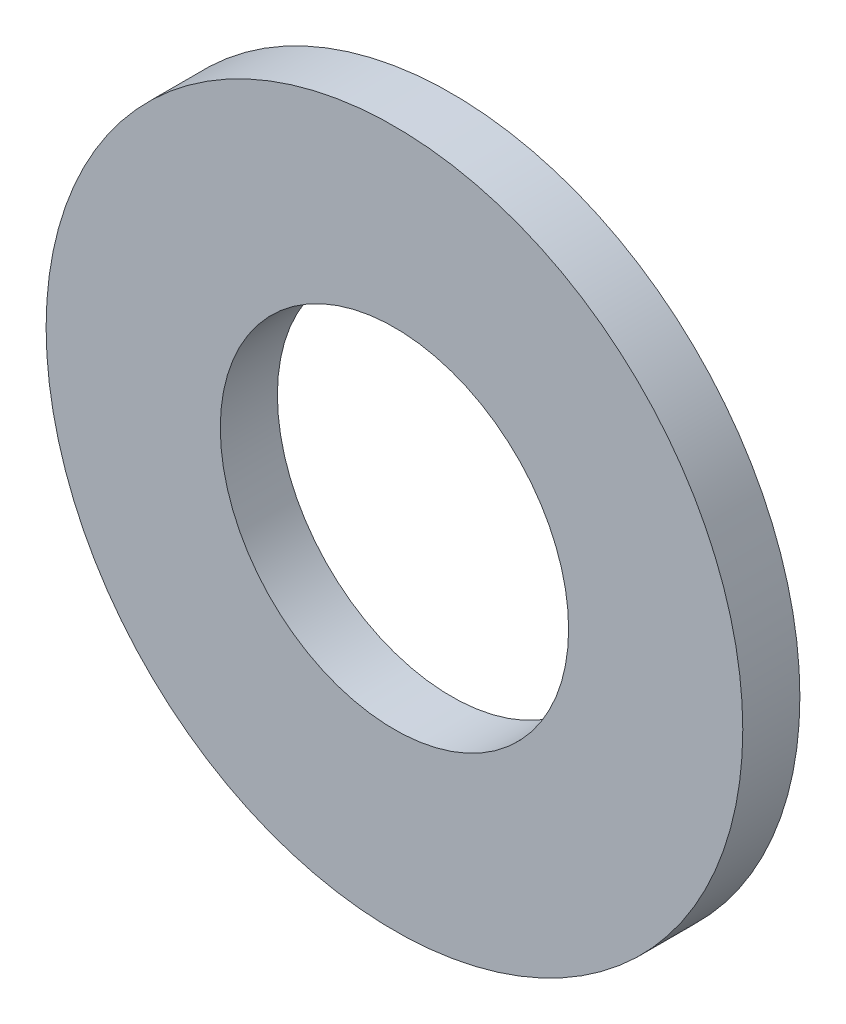
ISO-10303-21;
HEADER;
FILE_DESCRIPTION(('STEP AP214'),'2;1');
FILE_NAME('part.step','',(''),(''),'','','');
FILE_SCHEMA(('AUTOMOTIVE_DESIGN { 1 0 10303 214 1 1 1 1 }'));
ENDSEC;
DATA;
#1=APPLICATION_CONTEXT('core data for automotive mechanical design processes');
#2=APPLICATION_PROTOCOL_DEFINITION('international standard','automotive_design',2000,#1);
#3=PRODUCT_CONTEXT('',#1,'mechanical');
#4=PRODUCT('Part','Part','',(#3));
#5=PRODUCT_RELATED_PRODUCT_CATEGORY('part','',(#4));
#6=PRODUCT_DEFINITION_FORMATION('','',#4);
#7=PRODUCT_DEFINITION_CONTEXT('part definition',#1,'design');
#8=PRODUCT_DEFINITION('design','',#6,#7);
#9=PRODUCT_DEFINITION_SHAPE('','',#8);
#10=(LENGTH_UNIT() NAMED_UNIT(*) SI_UNIT(.MILLI.,.METRE.));
#11=(NAMED_UNIT(*) PLANE_ANGLE_UNIT() SI_UNIT($,.RADIAN.));
#12=(NAMED_UNIT(*) SI_UNIT($,.STERADIAN.) SOLID_ANGLE_UNIT());
#13=UNCERTAINTY_MEASURE_WITH_UNIT(LENGTH_MEASURE(1.E-05),#10,'distance_accuracy_value','');
#14=(GEOMETRIC_REPRESENTATION_CONTEXT(3) GLOBAL_UNCERTAINTY_ASSIGNED_CONTEXT((#13)) GLOBAL_UNIT_ASSIGNED_CONTEXT((#10,
#11,#12)) REPRESENTATION_CONTEXT('',''));
#15=CARTESIAN_POINT('',(0.,0.,0.));
#16=DIRECTION('',(0.,0.,1.));
#17=DIRECTION('',(1.,0.,0.));
#18=AXIS2_PLACEMENT_3D('',#15,#16,#17);
#19=CARTESIAN_POINT('',(0.,0.,1.));
#20=DIRECTION('',(0.,0.,1.));
#21=DIRECTION('',(1.,0.,0.));
#22=AXIS2_PLACEMENT_3D('',#19,#20,#21);
#23=PLANE('',#22);
#24=CARTESIAN_POINT('',(0.,0.,1.));
#25=DIRECTION('',(0.,0.,1.));
#26=DIRECTION('',(1.,0.,0.));
#27=AXIS2_PLACEMENT_3D('',#24,#25,#26);
#28=CIRCLE('',#27,6.1);
#29=CARTESIAN_POINT('',(6.1,0.,1.));
#30=VERTEX_POINT('',#29);
#31=EDGE_CURVE('E10',#30,#30,#28,.T.);
#32=ORIENTED_EDGE('',*,*,#31,.T.);
#33=EDGE_LOOP('',(#32));
#34=FACE_BOUND('',#33,.T.);
#35=CARTESIAN_POINT('',(0.,0.,1.));
#36=DIRECTION('',(0.,0.,1.));
#37=DIRECTION('',(1.,0.,0.));
#38=AXIS2_PLACEMENT_3D('',#35,#36,#37);
#39=CIRCLE('',#38,3.05);
#40=CARTESIAN_POINT('',(3.05,0.,1.));
#41=VERTEX_POINT('',#40);
#42=EDGE_CURVE('E47',#41,#41,#39,.T.);
#43=ORIENTED_EDGE('',*,*,#42,.F.);
#44=EDGE_LOOP('',(#43));
#45=FACE_BOUND('',#44,.T.);
#46=ADVANCED_FACE('F34',(#34,#45),#23,.T.);
#47=CARTESIAN_POINT('',(0.,0.,0.));
#48=DIRECTION('',(0.,0.,1.));
#49=DIRECTION('',(1.,0.,0.));
#50=AXIS2_PLACEMENT_3D('',#47,#48,#49);
#51=PLANE('',#50);
#52=CARTESIAN_POINT('',(0.,0.,0.));
#53=DIRECTION('',(0.,0.,1.));
#54=DIRECTION('',(1.,0.,0.));
#55=AXIS2_PLACEMENT_3D('',#52,#53,#54);
#56=CIRCLE('',#55,6.1);
#57=CARTESIAN_POINT('',(6.1,0.,0.));
#58=VERTEX_POINT('',#57);
#59=EDGE_CURVE('E38',#58,#58,#56,.T.);
#60=ORIENTED_EDGE('',*,*,#59,.F.);
#61=EDGE_LOOP('',(#60));
#62=FACE_BOUND('',#61,.T.);
#63=CARTESIAN_POINT('',(0.,0.,0.));
#64=DIRECTION('',(0.,0.,1.));
#65=DIRECTION('',(1.,0.,0.));
#66=AXIS2_PLACEMENT_3D('',#63,#64,#65);
#67=CIRCLE('',#66,3.05);
#68=CARTESIAN_POINT('',(3.05,0.,0.));
#69=VERTEX_POINT('',#68);
#70=EDGE_CURVE('E49',#69,#69,#67,.T.);
#71=ORIENTED_EDGE('',*,*,#70,.T.);
#72=EDGE_LOOP('',(#71));
#73=FACE_BOUND('',#72,.T.);
#74=ADVANCED_FACE('F61',(#62,#73),#51,.F.);
#75=CARTESIAN_POINT('',(0.,0.,1.));
#76=DIRECTION('',(0.,0.,-1.));
#77=DIRECTION('',(-1.,0.,0.));
#78=AXIS2_PLACEMENT_3D('',#75,#76,#77);
#79=CYLINDRICAL_SURFACE('',#78,6.1);
#80=ORIENTED_EDGE('',*,*,#31,.F.);
#81=EDGE_LOOP('',(#80));
#82=FACE_BOUND('',#81,.T.);
#83=ORIENTED_EDGE('',*,*,#59,.T.);
#84=EDGE_LOOP('',(#83));
#85=FACE_BOUND('',#84,.T.);
#86=ADVANCED_FACE('F36',(#82,#85),#79,.T.);
#87=CARTESIAN_POINT('',(0.,0.,1.));
#88=DIRECTION('',(0.,0.,-1.));
#89=DIRECTION('',(-1.,0.,0.));
#90=AXIS2_PLACEMENT_3D('',#87,#88,#89);
#91=CYLINDRICAL_SURFACE('',#90,3.05);
#92=ORIENTED_EDGE('',*,*,#42,.T.);
#93=EDGE_LOOP('',(#92));
#94=FACE_BOUND('',#93,.T.);
#95=ORIENTED_EDGE('',*,*,#70,.F.);
#96=EDGE_LOOP('',(#95));
#97=FACE_BOUND('',#96,.T.);
#98=ADVANCED_FACE('F57',(#94,#97),#91,.F.);
#99=CLOSED_SHELL('',(#46,#74,#86,#98));
#100=MANIFOLD_SOLID_BREP('B2',#99);
#101=ADVANCED_BREP_SHAPE_REPRESENTATION('',(#18,#100),#14);
#102=SHAPE_DEFINITION_REPRESENTATION(#9,#101);
ENDSEC;
END-ISO-10303-21;
